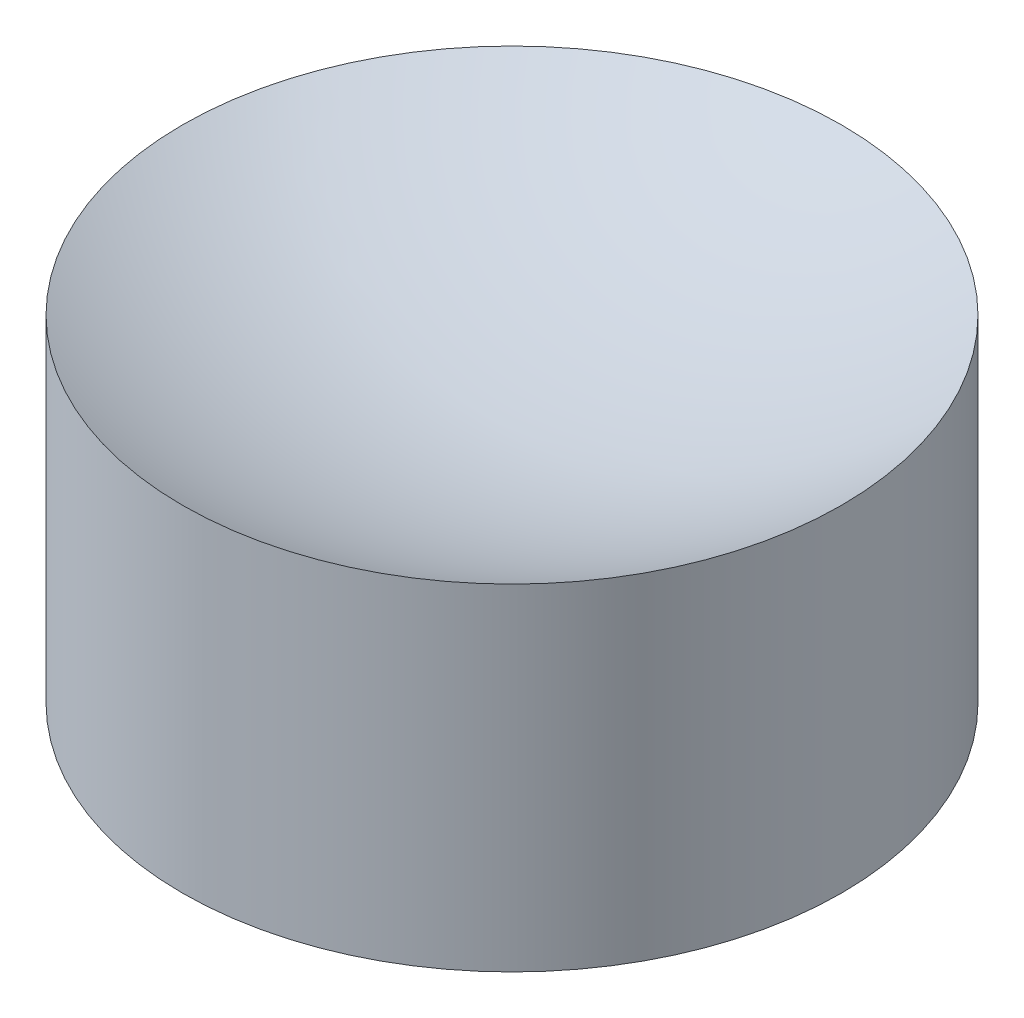
ISO-10303-21;
HEADER;
FILE_DESCRIPTION(('STEP AP214'),'2;1');
FILE_NAME('part.step','',(''),(''),'','','');
FILE_SCHEMA(('AUTOMOTIVE_DESIGN { 1 0 10303 214 1 1 1 1 }'));
ENDSEC;
DATA;
#1=APPLICATION_CONTEXT('core data for automotive mechanical design processes');
#2=APPLICATION_PROTOCOL_DEFINITION('international standard','automotive_design',2000,#1);
#3=PRODUCT_CONTEXT('',#1,'mechanical');
#4=PRODUCT('Part','Part','',(#3));
#5=PRODUCT_RELATED_PRODUCT_CATEGORY('part','',(#4));
#6=PRODUCT_DEFINITION_FORMATION('','',#4);
#7=PRODUCT_DEFINITION_CONTEXT('part definition',#1,'design');
#8=PRODUCT_DEFINITION('design','',#6,#7);
#9=PRODUCT_DEFINITION_SHAPE('','',#8);
#10=(LENGTH_UNIT() NAMED_UNIT(*) SI_UNIT(.MILLI.,.METRE.));
#11=(NAMED_UNIT(*) PLANE_ANGLE_UNIT() SI_UNIT($,.RADIAN.));
#12=(NAMED_UNIT(*) SI_UNIT($,.STERADIAN.) SOLID_ANGLE_UNIT());
#13=UNCERTAINTY_MEASURE_WITH_UNIT(LENGTH_MEASURE(1.E-05),#10,'distance_accuracy_value','');
#14=(GEOMETRIC_REPRESENTATION_CONTEXT(3) GLOBAL_UNCERTAINTY_ASSIGNED_CONTEXT((#13)) GLOBAL_UNIT_ASSIGNED_CONTEXT((#10,
#11,#12)) REPRESENTATION_CONTEXT('',''));
#15=CARTESIAN_POINT('',(0.,0.,0.));
#16=DIRECTION('',(0.,0.,1.));
#17=DIRECTION('',(1.,0.,0.));
#18=AXIS2_PLACEMENT_3D('',#15,#16,#17);
#19=CARTESIAN_POINT('',(-5.54223333892878E-13,5728.2445530465,-843.244434569781));
#20=DIRECTION('',(0.,0.,1.));
#21=DIRECTION('',(0.,1.,0.));
#22=AXIS2_PLACEMENT_3D('',#19,#20,#21);
#23=SPHERICAL_SURFACE('',#22,119.866084714525);
#24=CARTESIAN_POINT('',(8.56057144302489E-13,5830.83050854135,-843.244434569781));
#25=DIRECTION('',(0.,-1.,0.));
#26=DIRECTION('',(1.,0.,0.));
#27=AXIS2_PLACEMENT_3D('',#24,#25,#26);
#28=CIRCLE('',#27,62.);
#29=CARTESIAN_POINT('',(62.0000000000009,5830.83050854135,-843.244434569781));
#30=VERTEX_POINT('',#29);
#31=EDGE_CURVE('E19',#30,#30,#28,.F.);
#32=ORIENTED_EDGE('',*,*,#31,.F.);
#33=EDGE_LOOP('',(#32));
#34=FACE_BOUND('',#33,.T.);
#35=ADVANCED_FACE('F15',(#34),#23,.F.);
#36=CARTESIAN_POINT('',(-4.83169060316868E-13,6006.79363292537,-843.244434569781));
#37=DIRECTION('',(0.,0.,1.));
#38=DIRECTION('',(0.,-1.,0.));
#39=AXIS2_PLACEMENT_3D('',#36,#37,#38);
#40=SPHERICAL_SURFACE('',#39,128.682995164334);
#41=CARTESIAN_POINT('',(0.,5894.03143516183,-843.244434569781));
#42=DIRECTION('',(0.,-1.,0.));
#43=DIRECTION('',(1.,0.,0.));
#44=AXIS2_PLACEMENT_3D('',#41,#42,#43);
#45=CIRCLE('',#44,62.);
#46=CARTESIAN_POINT('',(61.9999999999999,5894.03143516183,-843.244434569781));
#47=VERTEX_POINT('',#46);
#48=EDGE_CURVE('E10',#47,#47,#45,.T.);
#49=ORIENTED_EDGE('',*,*,#48,.F.);
#50=EDGE_LOOP('',(#49));
#51=FACE_BOUND('',#50,.T.);
#52=ADVANCED_FACE('F30',(#51),#40,.F.);
#53=CARTESIAN_POINT('',(0.,5894.03143516183,-843.244434569781));
#54=DIRECTION('',(0.,-1.,0.));
#55=DIRECTION('',(1.,0.,0.));
#56=AXIS2_PLACEMENT_3D('',#53,#54,#55);
#57=CYLINDRICAL_SURFACE('',#56,62.);
#58=ORIENTED_EDGE('',*,*,#48,.T.);
#59=EDGE_LOOP('',(#58));
#60=FACE_BOUND('',#59,.T.);
#61=ORIENTED_EDGE('',*,*,#31,.T.);
#62=EDGE_LOOP('',(#61));
#63=FACE_BOUND('',#62,.T.);
#64=ADVANCED_FACE('F17',(#60,#63),#57,.T.);
#65=CLOSED_SHELL('',(#35,#52,#64));
#66=MANIFOLD_SOLID_BREP('B1',#65);
#67=ADVANCED_BREP_SHAPE_REPRESENTATION('',(#18,#66),#14);
#68=SHAPE_DEFINITION_REPRESENTATION(#9,#67);
ENDSEC;
END-ISO-10303-21;
